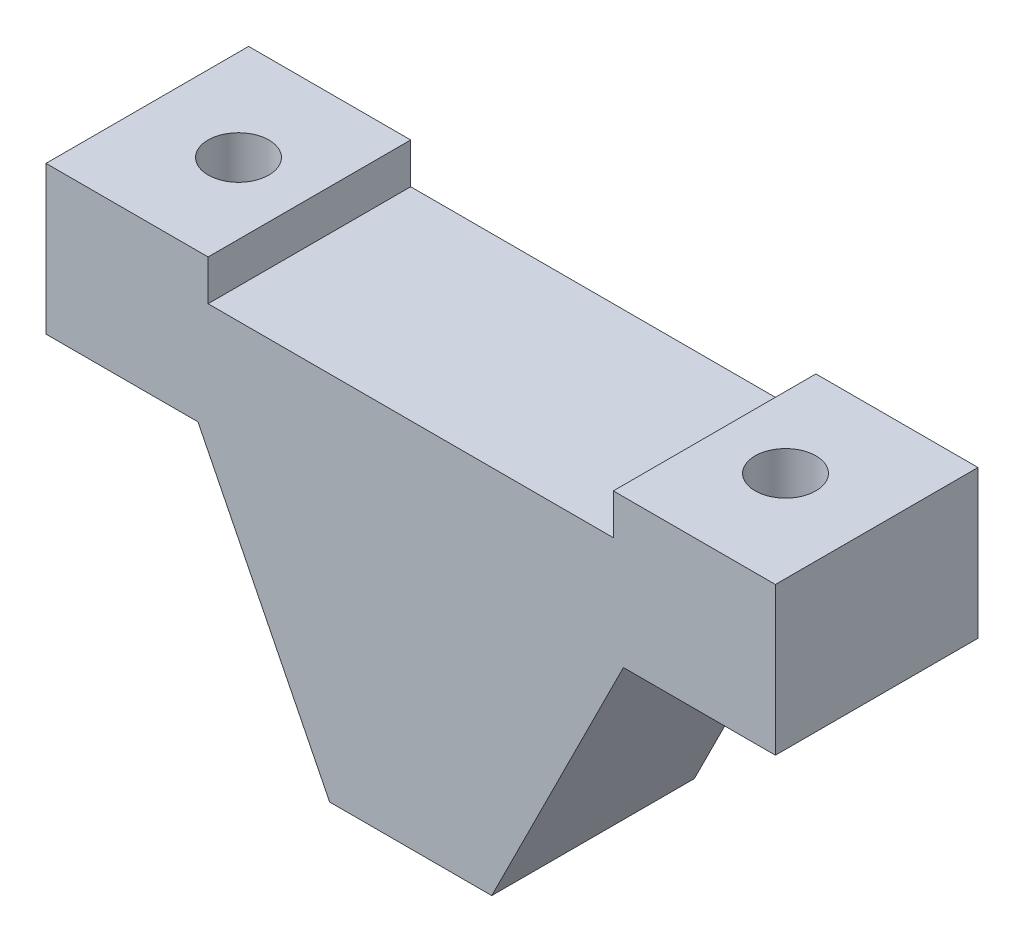
ISO-10303-21;
HEADER;
FILE_DESCRIPTION(('STEP AP214'),'2;1');
FILE_NAME('part.step','',(''),(''),'','','');
FILE_SCHEMA(('AUTOMOTIVE_DESIGN { 1 0 10303 214 1 1 1 1 }'));
ENDSEC;
DATA;
#1=APPLICATION_CONTEXT('core data for automotive mechanical design processes');
#2=APPLICATION_PROTOCOL_DEFINITION('international standard','automotive_design',2000,#1);
#3=PRODUCT_CONTEXT('',#1,'mechanical');
#4=PRODUCT('Part','Part','',(#3));
#5=PRODUCT_RELATED_PRODUCT_CATEGORY('part','',(#4));
#6=PRODUCT_DEFINITION_FORMATION('','',#4);
#7=PRODUCT_DEFINITION_CONTEXT('part definition',#1,'design');
#8=PRODUCT_DEFINITION('design','',#6,#7);
#9=PRODUCT_DEFINITION_SHAPE('','',#8);
#10=(LENGTH_UNIT() NAMED_UNIT(*) SI_UNIT(.MILLI.,.METRE.));
#11=(NAMED_UNIT(*) PLANE_ANGLE_UNIT() SI_UNIT($,.RADIAN.));
#12=(NAMED_UNIT(*) SI_UNIT($,.STERADIAN.) SOLID_ANGLE_UNIT());
#13=UNCERTAINTY_MEASURE_WITH_UNIT(LENGTH_MEASURE(1.E-05),#10,'distance_accuracy_value','');
#14=(GEOMETRIC_REPRESENTATION_CONTEXT(3) GLOBAL_UNCERTAINTY_ASSIGNED_CONTEXT((#13)) GLOBAL_UNIT_ASSIGNED_CONTEXT((#10,
#11,#12)) REPRESENTATION_CONTEXT('',''));
#15=CARTESIAN_POINT('',(0.,0.,0.));
#16=DIRECTION('',(0.,0.,1.));
#17=DIRECTION('',(1.,0.,0.));
#18=AXIS2_PLACEMENT_3D('',#15,#16,#17);
#19=CARTESIAN_POINT('',(18.,20.3,10.));
#20=DIRECTION('',(0.,-1.,0.));
#21=DIRECTION('',(1.,0.,0.));
#22=AXIS2_PLACEMENT_3D('',#19,#20,#21);
#23=PLANE('',#22);
#24=CARTESIAN_POINT('',(13.5,20.3,5.));
#25=DIRECTION('',(0.,-1.,0.));
#26=DIRECTION('',(1.,0.,0.));
#27=AXIS2_PLACEMENT_3D('',#24,#25,#26);
#28=CIRCLE('',#27,1.5);
#29=CARTESIAN_POINT('',(15.,20.3,5.));
#30=VERTEX_POINT('',#29);
#31=EDGE_CURVE('E177',#30,#30,#28,.T.);
#32=ORIENTED_EDGE('',*,*,#31,.T.);
#33=EDGE_LOOP('',(#32));
#34=FACE_BOUND('',#33,.T.);
#35=DIRECTION('',(-1.,0.,0.));
#36=VECTOR('',#35,1.);
#37=CARTESIAN_POINT('',(18.,20.3,0.));
#38=LINE('',#37,#36);
#39=CARTESIAN_POINT('',(18.,20.3,0.));
#40=VERTEX_POINT('',#39);
#41=CARTESIAN_POINT('',(10.,20.3,0.));
#42=VERTEX_POINT('',#41);
#43=EDGE_CURVE('E154',#40,#42,#38,.T.);
#44=ORIENTED_EDGE('',*,*,#43,.T.);
#45=DIRECTION('',(0.,0.,1.));
#46=VECTOR('',#45,1.);
#47=CARTESIAN_POINT('',(10.,20.3,0.));
#48=LINE('',#47,#46);
#49=CARTESIAN_POINT('',(10.,20.3,10.));
#50=VERTEX_POINT('',#49);
#51=EDGE_CURVE('E197',#42,#50,#48,.T.);
#52=ORIENTED_EDGE('',*,*,#51,.T.);
#53=DIRECTION('',(-1.,0.,0.));
#54=VECTOR('',#53,1.);
#55=CARTESIAN_POINT('',(18.,20.3,10.));
#56=LINE('',#55,#54);
#57=CARTESIAN_POINT('',(18.,20.3,10.));
#58=VERTEX_POINT('',#57);
#59=EDGE_CURVE('E219',#58,#50,#56,.T.);
#60=ORIENTED_EDGE('',*,*,#59,.F.);
#61=DIRECTION('',(0.,0.,-1.));
#62=VECTOR('',#61,1.);
#63=CARTESIAN_POINT('',(18.,20.3,10.));
#64=LINE('',#63,#62);
#65=EDGE_CURVE('E170',#58,#40,#64,.T.);
#66=ORIENTED_EDGE('',*,*,#65,.T.);
#67=EDGE_LOOP('',(#44,#52,#60,#66));
#68=FACE_BOUND('',#67,.T.);
#69=ADVANCED_FACE('F33',(#34,#68),#23,.F.);
#70=CARTESIAN_POINT('',(4.,0.,10.));
#71=DIRECTION('',(-0.894427190999916,0.447213595499958,0.));
#72=DIRECTION('',(-0.447213595499958,-0.894427190999916,0.));
#73=AXIS2_PLACEMENT_3D('',#70,#71,#72);
#74=PLANE('',#73);
#75=DIRECTION('',(0.447213595499958,0.894427190999916,0.));
#76=VECTOR('',#75,1.);
#77=CARTESIAN_POINT('',(4.,0.,0.));
#78=LINE('',#77,#76);
#79=CARTESIAN_POINT('',(4.,0.,0.));
#80=VERTEX_POINT('',#79);
#81=CARTESIAN_POINT('',(10.5,13.,0.));
#82=VERTEX_POINT('',#81);
#83=EDGE_CURVE('E145',#80,#82,#78,.T.);
#84=ORIENTED_EDGE('',*,*,#83,.T.);
#85=DIRECTION('',(0.,0.,-1.));
#86=VECTOR('',#85,1.);
#87=CARTESIAN_POINT('',(10.5,13.,10.));
#88=LINE('',#87,#86);
#89=CARTESIAN_POINT('',(10.5,13.,10.));
#90=VERTEX_POINT('',#89);
#91=EDGE_CURVE('E11',#90,#82,#88,.T.);
#92=ORIENTED_EDGE('',*,*,#91,.F.);
#93=DIRECTION('',(0.447213595499958,0.894427190999916,0.));
#94=VECTOR('',#93,1.);
#95=CARTESIAN_POINT('',(4.,0.,10.));
#96=LINE('',#95,#94);
#97=CARTESIAN_POINT('',(4.,0.,10.));
#98=VERTEX_POINT('',#97);
#99=EDGE_CURVE('E163',#98,#90,#96,.T.);
#100=ORIENTED_EDGE('',*,*,#99,.F.);
#101=DIRECTION('',(0.,0.,-1.));
#102=VECTOR('',#101,1.);
#103=CARTESIAN_POINT('',(4.,0.,10.));
#104=LINE('',#103,#102);
#105=EDGE_CURVE('E141',#98,#80,#104,.T.);
#106=ORIENTED_EDGE('',*,*,#105,.T.);
#107=EDGE_LOOP('',(#84,#92,#100,#106));
#108=FACE_BOUND('',#107,.T.);
#109=ADVANCED_FACE('F35',(#108),#74,.F.);
#110=CARTESIAN_POINT('',(10.5,13.,10.));
#111=DIRECTION('',(0.,1.,0.));
#112=DIRECTION('',(-1.,0.,0.));
#113=AXIS2_PLACEMENT_3D('',#110,#111,#112);
#114=PLANE('',#113);
#115=CARTESIAN_POINT('',(13.5,13.,5.));
#116=DIRECTION('',(0.,1.,0.));
#117=DIRECTION('',(-1.,0.,0.));
#118=AXIS2_PLACEMENT_3D('',#115,#116,#117);
#119=CIRCLE('',#118,1.5);
#120=CARTESIAN_POINT('',(12.,13.,5.));
#121=VERTEX_POINT('',#120);
#122=EDGE_CURVE('E37',#121,#121,#119,.T.);
#123=ORIENTED_EDGE('',*,*,#122,.T.);
#124=EDGE_LOOP('',(#123));
#125=FACE_BOUND('',#124,.T.);
#126=DIRECTION('',(1.,0.,0.));
#127=VECTOR('',#126,1.);
#128=CARTESIAN_POINT('',(10.5,13.,0.));
#129=LINE('',#128,#127);
#130=CARTESIAN_POINT('',(18.,13.,0.));
#131=VERTEX_POINT('',#130);
#132=EDGE_CURVE('E148',#82,#131,#129,.T.);
#133=ORIENTED_EDGE('',*,*,#132,.T.);
#134=DIRECTION('',(0.,0.,-1.));
#135=VECTOR('',#134,1.);
#136=CARTESIAN_POINT('',(18.,13.,10.));
#137=LINE('',#136,#135);
#138=CARTESIAN_POINT('',(18.,13.,10.));
#139=VERTEX_POINT('',#138);
#140=EDGE_CURVE('E42',#139,#131,#137,.T.);
#141=ORIENTED_EDGE('',*,*,#140,.F.);
#142=DIRECTION('',(1.,0.,0.));
#143=VECTOR('',#142,1.);
#144=CARTESIAN_POINT('',(10.5,13.,10.));
#145=LINE('',#144,#143);
#146=EDGE_CURVE('E100',#90,#139,#145,.T.);
#147=ORIENTED_EDGE('',*,*,#146,.F.);
#148=ORIENTED_EDGE('',*,*,#91,.T.);
#149=EDGE_LOOP('',(#133,#141,#147,#148));
#150=FACE_BOUND('',#149,.T.);
#151=ADVANCED_FACE('F244',(#125,#150),#114,.F.);
#152=CARTESIAN_POINT('',(18.,13.,10.));
#153=DIRECTION('',(-1.,0.,0.));
#154=DIRECTION('',(0.,0.,1.));
#155=AXIS2_PLACEMENT_3D('',#152,#153,#154);
#156=PLANE('',#155);
#157=DIRECTION('',(0.,1.,0.));
#158=VECTOR('',#157,1.);
#159=CARTESIAN_POINT('',(18.,13.,0.));
#160=LINE('',#159,#158);
#161=EDGE_CURVE('E151',#131,#40,#160,.T.);
#162=ORIENTED_EDGE('',*,*,#161,.T.);
#163=ORIENTED_EDGE('',*,*,#65,.F.);
#164=DIRECTION('',(0.,1.,0.));
#165=VECTOR('',#164,1.);
#166=CARTESIAN_POINT('',(18.,13.,10.));
#167=LINE('',#166,#165);
#168=EDGE_CURVE('E216',#139,#58,#167,.T.);
#169=ORIENTED_EDGE('',*,*,#168,.F.);
#170=ORIENTED_EDGE('',*,*,#140,.T.);
#171=EDGE_LOOP('',(#162,#163,#169,#170));
#172=FACE_BOUND('',#171,.T.);
#173=ADVANCED_FACE('F247',(#172),#156,.F.);
#174=CARTESIAN_POINT('',(-13.5,20.3,5.));
#175=DIRECTION('',(0.,-1.,0.));
#176=DIRECTION('',(1.,0.,0.));
#177=AXIS2_PLACEMENT_3D('',#174,#175,#176);
#178=CIRCLE('',#177,1.5);
#179=CARTESIAN_POINT('',(-12.,20.3,5.));
#180=VERTEX_POINT('',#179);
#181=EDGE_CURVE('E176',#180,#180,#178,.T.);
#182=ORIENTED_EDGE('',*,*,#181,.T.);
#183=EDGE_LOOP('',(#182));
#184=FACE_BOUND('',#183,.T.);
#185=CARTESIAN_POINT('',(-10.,20.3,10.));
#186=VERTEX_POINT('',#185);
#187=CARTESIAN_POINT('',(-18.,20.3,10.));
#188=VERTEX_POINT('',#187);
#189=EDGE_CURVE('E218',#186,#188,#56,.T.);
#190=ORIENTED_EDGE('',*,*,#189,.F.);
#191=DIRECTION('',(0.,0.,1.));
#192=VECTOR('',#191,1.);
#193=CARTESIAN_POINT('',(-10.,20.3,0.));
#194=LINE('',#193,#192);
#195=CARTESIAN_POINT('',(-10.,20.3,0.));
#196=VERTEX_POINT('',#195);
#197=EDGE_CURVE('E209',#196,#186,#194,.T.);
#198=ORIENTED_EDGE('',*,*,#197,.F.);
#199=CARTESIAN_POINT('',(-18.,20.3,0.));
#200=VERTEX_POINT('',#199);
#201=EDGE_CURVE('E153',#196,#200,#38,.T.);
#202=ORIENTED_EDGE('',*,*,#201,.T.);
#203=DIRECTION('',(0.,0.,-1.));
#204=VECTOR('',#203,1.);
#205=CARTESIAN_POINT('',(-18.,20.3,10.));
#206=LINE('',#205,#204);
#207=EDGE_CURVE('E167',#188,#200,#206,.T.);
#208=ORIENTED_EDGE('',*,*,#207,.F.);
#209=EDGE_LOOP('',(#190,#198,#202,#208));
#210=FACE_BOUND('',#209,.T.);
#211=ADVANCED_FACE('F230',(#184,#210),#23,.F.);
#212=CARTESIAN_POINT('',(-18.,13.,10.));
#213=DIRECTION('',(1.,0.,0.));
#214=DIRECTION('',(0.,0.,-1.));
#215=AXIS2_PLACEMENT_3D('',#212,#213,#214);
#216=PLANE('',#215);
#217=DIRECTION('',(0.,-1.,0.));
#218=VECTOR('',#217,1.);
#219=CARTESIAN_POINT('',(-18.,13.,0.));
#220=LINE('',#219,#218);
#221=CARTESIAN_POINT('',(-18.,13.,0.));
#222=VERTEX_POINT('',#221);
#223=EDGE_CURVE('E157',#200,#222,#220,.T.);
#224=ORIENTED_EDGE('',*,*,#223,.T.);
#225=DIRECTION('',(0.,0.,-1.));
#226=VECTOR('',#225,1.);
#227=CARTESIAN_POINT('',(-18.,13.,10.));
#228=LINE('',#227,#226);
#229=CARTESIAN_POINT('',(-18.,13.,10.));
#230=VERTEX_POINT('',#229);
#231=EDGE_CURVE('E136',#230,#222,#228,.T.);
#232=ORIENTED_EDGE('',*,*,#231,.F.);
#233=DIRECTION('',(0.,-1.,0.));
#234=VECTOR('',#233,1.);
#235=CARTESIAN_POINT('',(-18.,13.,10.));
#236=LINE('',#235,#234);
#237=EDGE_CURVE('E124',#188,#230,#236,.T.);
#238=ORIENTED_EDGE('',*,*,#237,.F.);
#239=ORIENTED_EDGE('',*,*,#207,.T.);
#240=EDGE_LOOP('',(#224,#232,#238,#239));
#241=FACE_BOUND('',#240,.T.);
#242=ADVANCED_FACE('F234',(#241),#216,.F.);
#243=CARTESIAN_POINT('',(-10.5,13.,10.));
#244=DIRECTION('',(0.,1.,0.));
#245=DIRECTION('',(0.,0.,1.));
#246=AXIS2_PLACEMENT_3D('',#243,#244,#245);
#247=PLANE('',#246);
#248=CARTESIAN_POINT('',(-13.5,13.,5.));
#249=DIRECTION('',(0.,1.,0.));
#250=DIRECTION('',(0.,0.,1.));
#251=AXIS2_PLACEMENT_3D('',#248,#249,#250);
#252=CIRCLE('',#251,1.5);
#253=CARTESIAN_POINT('',(-13.5,13.,6.5));
#254=VERTEX_POINT('',#253);
#255=EDGE_CURVE('E174',#254,#254,#252,.T.);
#256=ORIENTED_EDGE('',*,*,#255,.T.);
#257=EDGE_LOOP('',(#256));
#258=FACE_BOUND('',#257,.T.);
#259=DIRECTION('',(1.,0.,0.));
#260=VECTOR('',#259,1.);
#261=CARTESIAN_POINT('',(-10.5,13.,0.));
#262=LINE('',#261,#260);
#263=CARTESIAN_POINT('',(-10.5,13.,0.));
#264=VERTEX_POINT('',#263);
#265=EDGE_CURVE('E133',#222,#264,#262,.T.);
#266=ORIENTED_EDGE('',*,*,#265,.T.);
#267=DIRECTION('',(0.,0.,-1.));
#268=VECTOR('',#267,1.);
#269=CARTESIAN_POINT('',(-10.5,13.,10.));
#270=LINE('',#269,#268);
#271=CARTESIAN_POINT('',(-10.5,13.,10.));
#272=VERTEX_POINT('',#271);
#273=EDGE_CURVE('E130',#272,#264,#270,.T.);
#274=ORIENTED_EDGE('',*,*,#273,.F.);
#275=DIRECTION('',(1.,0.,0.));
#276=VECTOR('',#275,1.);
#277=CARTESIAN_POINT('',(-10.5,13.,10.));
#278=LINE('',#277,#276);
#279=EDGE_CURVE('E116',#230,#272,#278,.T.);
#280=ORIENTED_EDGE('',*,*,#279,.F.);
#281=ORIENTED_EDGE('',*,*,#231,.T.);
#282=EDGE_LOOP('',(#266,#274,#280,#281));
#283=FACE_BOUND('',#282,.T.);
#284=ADVANCED_FACE('F131',(#258,#283),#247,.F.);
#285=CARTESIAN_POINT('',(-4.,0.,10.));
#286=DIRECTION('',(0.894427190999916,0.447213595499958,0.));
#287=DIRECTION('',(-0.447213595499958,0.894427190999916,0.));
#288=AXIS2_PLACEMENT_3D('',#285,#286,#287);
#289=PLANE('',#288);
#290=DIRECTION('',(0.447213595499958,-0.894427190999916,0.));
#291=VECTOR('',#290,1.);
#292=CARTESIAN_POINT('',(-4.,0.,0.));
#293=LINE('',#292,#291);
#294=CARTESIAN_POINT('',(-4.,0.,0.));
#295=VERTEX_POINT('',#294);
#296=EDGE_CURVE('E160',#264,#295,#293,.T.);
#297=ORIENTED_EDGE('',*,*,#296,.T.);
#298=DIRECTION('',(0.,0.,-1.));
#299=VECTOR('',#298,1.);
#300=CARTESIAN_POINT('',(-4.,0.,10.));
#301=LINE('',#300,#299);
#302=CARTESIAN_POINT('',(-4.,0.,10.));
#303=VERTEX_POINT('',#302);
#304=EDGE_CURVE('E137',#303,#295,#301,.T.);
#305=ORIENTED_EDGE('',*,*,#304,.F.);
#306=DIRECTION('',(0.447213595499958,-0.894427190999916,0.));
#307=VECTOR('',#306,1.);
#308=CARTESIAN_POINT('',(-4.,0.,10.));
#309=LINE('',#308,#307);
#310=EDGE_CURVE('E121',#272,#303,#309,.T.);
#311=ORIENTED_EDGE('',*,*,#310,.F.);
#312=ORIENTED_EDGE('',*,*,#273,.T.);
#313=EDGE_LOOP('',(#297,#305,#311,#312));
#314=FACE_BOUND('',#313,.T.);
#315=ADVANCED_FACE('F139',(#314),#289,.F.);
#316=CARTESIAN_POINT('',(-4.,0.,10.));
#317=DIRECTION('',(0.,1.,0.));
#318=DIRECTION('',(0.,0.,1.));
#319=AXIS2_PLACEMENT_3D('',#316,#317,#318);
#320=PLANE('',#319);
#321=DIRECTION('',(1.,0.,0.));
#322=VECTOR('',#321,1.);
#323=CARTESIAN_POINT('',(-4.,0.,0.));
#324=LINE('',#323,#322);
#325=EDGE_CURVE('E92',#295,#80,#324,.T.);
#326=ORIENTED_EDGE('',*,*,#325,.T.);
#327=ORIENTED_EDGE('',*,*,#105,.F.);
#328=DIRECTION('',(1.,0.,0.));
#329=VECTOR('',#328,1.);
#330=CARTESIAN_POINT('',(-4.,0.,10.));
#331=LINE('',#330,#329);
#332=EDGE_CURVE('E59',#303,#98,#331,.T.);
#333=ORIENTED_EDGE('',*,*,#332,.F.);
#334=ORIENTED_EDGE('',*,*,#304,.T.);
#335=EDGE_LOOP('',(#326,#327,#333,#334));
#336=FACE_BOUND('',#335,.T.);
#337=ADVANCED_FACE('F238',(#336),#320,.F.);
#338=CARTESIAN_POINT('',(0.,0.,10.));
#339=DIRECTION('',(0.,0.,-1.));
#340=DIRECTION('',(-1.,0.,0.));
#341=AXIS2_PLACEMENT_3D('',#338,#339,#340);
#342=PLANE('',#341);
#343=ORIENTED_EDGE('',*,*,#59,.T.);
#344=DIRECTION('',(0.,1.,0.));
#345=VECTOR('',#344,1.);
#346=CARTESIAN_POINT('',(10.,18.3,10.));
#347=LINE('',#346,#345);
#348=CARTESIAN_POINT('',(10.,18.3,10.));
#349=VERTEX_POINT('',#348);
#350=EDGE_CURVE('E181',#349,#50,#347,.T.);
#351=ORIENTED_EDGE('',*,*,#350,.F.);
#352=DIRECTION('',(1.,0.,0.));
#353=VECTOR('',#352,1.);
#354=CARTESIAN_POINT('',(-10.,18.3,10.));
#355=LINE('',#354,#353);
#356=CARTESIAN_POINT('',(-10.,18.3,10.));
#357=VERTEX_POINT('',#356);
#358=EDGE_CURVE('E193',#357,#349,#355,.T.);
#359=ORIENTED_EDGE('',*,*,#358,.F.);
#360=DIRECTION('',(0.,-1.,0.));
#361=VECTOR('',#360,1.);
#362=CARTESIAN_POINT('',(-10.,18.3,10.));
#363=LINE('',#362,#361);
#364=EDGE_CURVE('E200',#186,#357,#363,.T.);
#365=ORIENTED_EDGE('',*,*,#364,.F.);
#366=ORIENTED_EDGE('',*,*,#189,.T.);
#367=ORIENTED_EDGE('',*,*,#237,.T.);
#368=ORIENTED_EDGE('',*,*,#279,.T.);
#369=ORIENTED_EDGE('',*,*,#310,.T.);
#370=ORIENTED_EDGE('',*,*,#332,.T.);
#371=ORIENTED_EDGE('',*,*,#99,.T.);
#372=ORIENTED_EDGE('',*,*,#146,.T.);
#373=ORIENTED_EDGE('',*,*,#168,.T.);
#374=EDGE_LOOP('',(#343,#351,#359,#365,#366,#367,#368,#369,#370,#371,#372,#373));
#375=FACE_BOUND('',#374,.T.);
#376=ADVANCED_FACE('F119',(#375),#342,.F.);
#377=CARTESIAN_POINT('',(0.,0.,0.));
#378=DIRECTION('',(0.,0.,-1.));
#379=DIRECTION('',(-1.,0.,0.));
#380=AXIS2_PLACEMENT_3D('',#377,#378,#379);
#381=PLANE('',#380);
#382=DIRECTION('',(0.,1.,0.));
#383=VECTOR('',#382,1.);
#384=CARTESIAN_POINT('',(10.,18.3,0.));
#385=LINE('',#384,#383);
#386=CARTESIAN_POINT('',(10.,18.3,0.));
#387=VERTEX_POINT('',#386);
#388=EDGE_CURVE('E189',#387,#42,#385,.T.);
#389=ORIENTED_EDGE('',*,*,#388,.T.);
#390=ORIENTED_EDGE('',*,*,#43,.F.);
#391=ORIENTED_EDGE('',*,*,#161,.F.);
#392=ORIENTED_EDGE('',*,*,#132,.F.);
#393=ORIENTED_EDGE('',*,*,#83,.F.);
#394=ORIENTED_EDGE('',*,*,#325,.F.);
#395=ORIENTED_EDGE('',*,*,#296,.F.);
#396=ORIENTED_EDGE('',*,*,#265,.F.);
#397=ORIENTED_EDGE('',*,*,#223,.F.);
#398=ORIENTED_EDGE('',*,*,#201,.F.);
#399=DIRECTION('',(0.,-1.,0.));
#400=VECTOR('',#399,1.);
#401=CARTESIAN_POINT('',(-10.,18.3,0.));
#402=LINE('',#401,#400);
#403=CARTESIAN_POINT('',(-10.,18.3,0.));
#404=VERTEX_POINT('',#403);
#405=EDGE_CURVE('E192',#196,#404,#402,.T.);
#406=ORIENTED_EDGE('',*,*,#405,.T.);
#407=DIRECTION('',(1.,0.,0.));
#408=VECTOR('',#407,1.);
#409=CARTESIAN_POINT('',(-10.,18.3,0.));
#410=LINE('',#409,#408);
#411=EDGE_CURVE('E50',#404,#387,#410,.T.);
#412=ORIENTED_EDGE('',*,*,#411,.T.);
#413=EDGE_LOOP('',(#389,#390,#391,#392,#393,#394,#395,#396,#397,#398,#406,#412));
#414=FACE_BOUND('',#413,.T.);
#415=ADVANCED_FACE('F236',(#414),#381,.T.);
#416=CARTESIAN_POINT('',(10.,18.3,0.));
#417=DIRECTION('',(1.,0.,0.));
#418=DIRECTION('',(0.,0.,-1.));
#419=AXIS2_PLACEMENT_3D('',#416,#417,#418);
#420=PLANE('',#419);
#421=ORIENTED_EDGE('',*,*,#350,.T.);
#422=ORIENTED_EDGE('',*,*,#51,.F.);
#423=ORIENTED_EDGE('',*,*,#388,.F.);
#424=DIRECTION('',(0.,0.,1.));
#425=VECTOR('',#424,1.);
#426=CARTESIAN_POINT('',(10.,18.3,0.));
#427=LINE('',#426,#425);
#428=EDGE_CURVE('E149',#387,#349,#427,.T.);
#429=ORIENTED_EDGE('',*,*,#428,.T.);
#430=EDGE_LOOP('',(#421,#422,#423,#429));
#431=FACE_BOUND('',#430,.T.);
#432=ADVANCED_FACE('F255',(#431),#420,.F.);
#433=CARTESIAN_POINT('',(-10.,18.3,0.));
#434=DIRECTION('',(0.,-1.,0.));
#435=DIRECTION('',(1.,0.,0.));
#436=AXIS2_PLACEMENT_3D('',#433,#434,#435);
#437=PLANE('',#436);
#438=ORIENTED_EDGE('',*,*,#358,.T.);
#439=ORIENTED_EDGE('',*,*,#428,.F.);
#440=ORIENTED_EDGE('',*,*,#411,.F.);
#441=DIRECTION('',(0.,0.,1.));
#442=VECTOR('',#441,1.);
#443=CARTESIAN_POINT('',(-10.,18.3,0.));
#444=LINE('',#443,#442);
#445=EDGE_CURVE('E207',#404,#357,#444,.T.);
#446=ORIENTED_EDGE('',*,*,#445,.T.);
#447=EDGE_LOOP('',(#438,#439,#440,#446));
#448=FACE_BOUND('',#447,.T.);
#449=ADVANCED_FACE('F263',(#448),#437,.F.);
#450=CARTESIAN_POINT('',(-10.,18.3,0.));
#451=DIRECTION('',(-1.,0.,0.));
#452=DIRECTION('',(0.,0.,1.));
#453=AXIS2_PLACEMENT_3D('',#450,#451,#452);
#454=PLANE('',#453);
#455=ORIENTED_EDGE('',*,*,#364,.T.);
#456=ORIENTED_EDGE('',*,*,#445,.F.);
#457=ORIENTED_EDGE('',*,*,#405,.F.);
#458=ORIENTED_EDGE('',*,*,#197,.T.);
#459=EDGE_LOOP('',(#455,#456,#457,#458));
#460=FACE_BOUND('',#459,.T.);
#461=ADVANCED_FACE('F265',(#460),#454,.F.);
#462=CARTESIAN_POINT('',(-13.5,0.,5.));
#463=DIRECTION('',(0.,1.,0.));
#464=DIRECTION('',(-1.,0.,0.));
#465=AXIS2_PLACEMENT_3D('',#462,#463,#464);
#466=CYLINDRICAL_SURFACE('',#465,1.5);
#467=ORIENTED_EDGE('',*,*,#255,.F.);
#468=EDGE_LOOP('',(#467));
#469=FACE_BOUND('',#468,.T.);
#470=ORIENTED_EDGE('',*,*,#181,.F.);
#471=EDGE_LOOP('',(#470));
#472=FACE_BOUND('',#471,.T.);
#473=ADVANCED_FACE('F271',(#469,#472),#466,.F.);
#474=CARTESIAN_POINT('',(13.5,0.,5.));
#475=DIRECTION('',(0.,1.,0.));
#476=DIRECTION('',(-1.,0.,0.));
#477=AXIS2_PLACEMENT_3D('',#474,#475,#476);
#478=CYLINDRICAL_SURFACE('',#477,1.5);
#479=ORIENTED_EDGE('',*,*,#122,.F.);
#480=EDGE_LOOP('',(#479));
#481=FACE_BOUND('',#480,.T.);
#482=ORIENTED_EDGE('',*,*,#31,.F.);
#483=EDGE_LOOP('',(#482));
#484=FACE_BOUND('',#483,.T.);
#485=ADVANCED_FACE('F292',(#481,#484),#478,.F.);
#486=CLOSED_SHELL('',(#69,#109,#151,#173,#211,#242,#284,#315,#337,#376,#415,#432,#449,#461,#473,#485));
#487=MANIFOLD_SOLID_BREP('B2',#486);
#488=ADVANCED_BREP_SHAPE_REPRESENTATION('',(#18,#487),#14);
#489=SHAPE_DEFINITION_REPRESENTATION(#9,#488);
ENDSEC;
END-ISO-10303-21;
